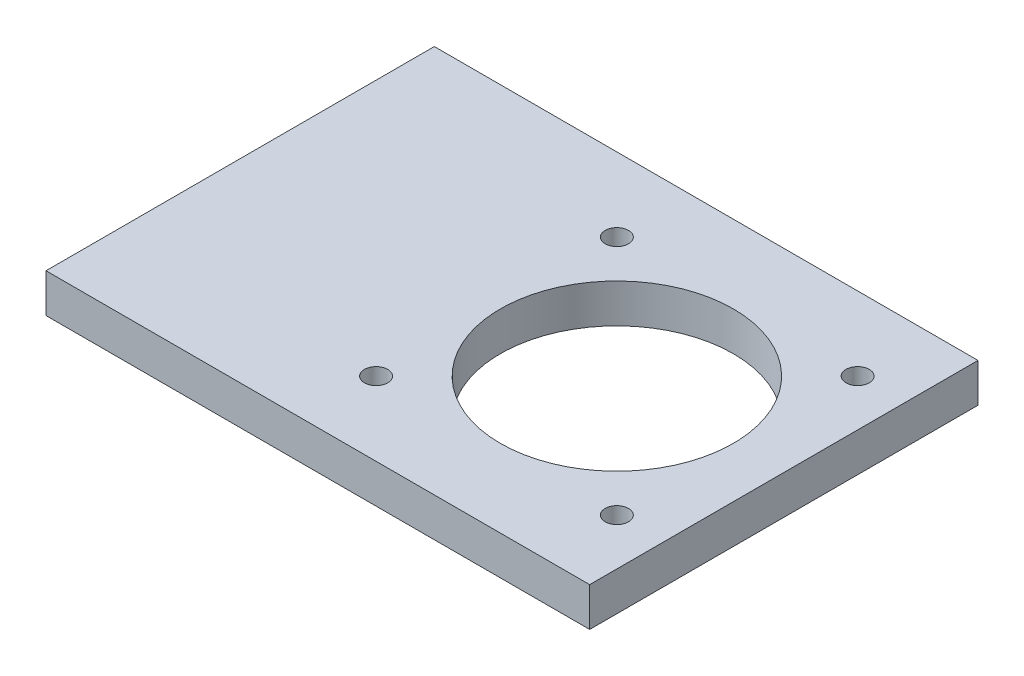
ISO-10303-21;
HEADER;
FILE_DESCRIPTION(('STEP AP214'),'2;1');
FILE_NAME('part.step','',(''),(''),'','','');
FILE_SCHEMA(('AUTOMOTIVE_DESIGN { 1 0 10303 214 1 1 1 1 }'));
ENDSEC;
DATA;
#1=APPLICATION_CONTEXT('core data for automotive mechanical design processes');
#2=APPLICATION_PROTOCOL_DEFINITION('international standard','automotive_design',2000,#1);
#3=PRODUCT_CONTEXT('',#1,'mechanical');
#4=PRODUCT('Part','Part','',(#3));
#5=PRODUCT_RELATED_PRODUCT_CATEGORY('part','',(#4));
#6=PRODUCT_DEFINITION_FORMATION('','',#4);
#7=PRODUCT_DEFINITION_CONTEXT('part definition',#1,'design');
#8=PRODUCT_DEFINITION('design','',#6,#7);
#9=PRODUCT_DEFINITION_SHAPE('','',#8);
#10=(LENGTH_UNIT() NAMED_UNIT(*) SI_UNIT(.MILLI.,.METRE.));
#11=(NAMED_UNIT(*) PLANE_ANGLE_UNIT() SI_UNIT($,.RADIAN.));
#12=(NAMED_UNIT(*) SI_UNIT($,.STERADIAN.) SOLID_ANGLE_UNIT());
#13=UNCERTAINTY_MEASURE_WITH_UNIT(LENGTH_MEASURE(1.E-05),#10,'distance_accuracy_value','');
#14=(GEOMETRIC_REPRESENTATION_CONTEXT(3) GLOBAL_UNCERTAINTY_ASSIGNED_CONTEXT((#13)) GLOBAL_UNIT_ASSIGNED_CONTEXT((#10,
#11,#12)) REPRESENTATION_CONTEXT('',''));
#15=CARTESIAN_POINT('',(0.,0.,0.));
#16=DIRECTION('',(0.,0.,1.));
#17=DIRECTION('',(1.,0.,0.));
#18=AXIS2_PLACEMENT_3D('',#15,#16,#17);
#19=CARTESIAN_POINT('',(-35.,5.,25.));
#20=DIRECTION('',(1.,0.,0.));
#21=DIRECTION('',(0.,0.,-1.));
#22=AXIS2_PLACEMENT_3D('',#19,#20,#21);
#23=PLANE('',#22);
#24=DIRECTION('',(0.,0.,1.));
#25=VECTOR('',#24,1.);
#26=CARTESIAN_POINT('',(-35.,0.,25.));
#27=LINE('',#26,#25);
#28=CARTESIAN_POINT('',(-35.,0.,-25.));
#29=VERTEX_POINT('',#28);
#30=CARTESIAN_POINT('',(-35.,0.,25.));
#31=VERTEX_POINT('',#30);
#32=EDGE_CURVE('E101',#29,#31,#27,.T.);
#33=ORIENTED_EDGE('',*,*,#32,.T.);
#34=DIRECTION('',(0.,-1.,0.));
#35=VECTOR('',#34,1.);
#36=CARTESIAN_POINT('',(-35.,5.,25.));
#37=LINE('',#36,#35);
#38=CARTESIAN_POINT('',(-35.,5.,25.));
#39=VERTEX_POINT('',#38);
#40=EDGE_CURVE('E11',#39,#31,#37,.T.);
#41=ORIENTED_EDGE('',*,*,#40,.F.);
#42=DIRECTION('',(0.,0.,1.));
#43=VECTOR('',#42,1.);
#44=CARTESIAN_POINT('',(-35.,5.,25.));
#45=LINE('',#44,#43);
#46=CARTESIAN_POINT('',(-35.,5.,-25.));
#47=VERTEX_POINT('',#46);
#48=EDGE_CURVE('E89',#47,#39,#45,.T.);
#49=ORIENTED_EDGE('',*,*,#48,.F.);
#50=DIRECTION('',(0.,-1.,0.));
#51=VECTOR('',#50,1.);
#52=CARTESIAN_POINT('',(-35.,5.,-25.));
#53=LINE('',#52,#51);
#54=EDGE_CURVE('E97',#47,#29,#53,.T.);
#55=ORIENTED_EDGE('',*,*,#54,.T.);
#56=EDGE_LOOP('',(#33,#41,#49,#55));
#57=FACE_BOUND('',#56,.T.);
#58=ADVANCED_FACE('F38',(#57),#23,.F.);
#59=CARTESIAN_POINT('',(35.,5.,25.));
#60=DIRECTION('',(0.,0.,-1.));
#61=DIRECTION('',(-1.,0.,0.));
#62=AXIS2_PLACEMENT_3D('',#59,#60,#61);
#63=PLANE('',#62);
#64=DIRECTION('',(1.,0.,0.));
#65=VECTOR('',#64,1.);
#66=CARTESIAN_POINT('',(35.,0.,25.));
#67=LINE('',#66,#65);
#68=CARTESIAN_POINT('',(35.,0.,25.));
#69=VERTEX_POINT('',#68);
#70=EDGE_CURVE('E93',#31,#69,#67,.T.);
#71=ORIENTED_EDGE('',*,*,#70,.T.);
#72=DIRECTION('',(0.,-1.,0.));
#73=VECTOR('',#72,1.);
#74=CARTESIAN_POINT('',(35.,5.,25.));
#75=LINE('',#74,#73);
#76=CARTESIAN_POINT('',(35.,5.,25.));
#77=VERTEX_POINT('',#76);
#78=EDGE_CURVE('E46',#77,#69,#75,.T.);
#79=ORIENTED_EDGE('',*,*,#78,.F.);
#80=DIRECTION('',(1.,0.,0.));
#81=VECTOR('',#80,1.);
#82=CARTESIAN_POINT('',(35.,5.,25.));
#83=LINE('',#82,#81);
#84=EDGE_CURVE('E84',#39,#77,#83,.T.);
#85=ORIENTED_EDGE('',*,*,#84,.F.);
#86=ORIENTED_EDGE('',*,*,#40,.T.);
#87=EDGE_LOOP('',(#71,#79,#85,#86));
#88=FACE_BOUND('',#87,.T.);
#89=ADVANCED_FACE('F92',(#88),#63,.F.);
#90=CARTESIAN_POINT('',(35.,5.,25.));
#91=DIRECTION('',(-1.,0.,0.));
#92=DIRECTION('',(0.,0.,1.));
#93=AXIS2_PLACEMENT_3D('',#90,#91,#92);
#94=PLANE('',#93);
#95=DIRECTION('',(0.,0.,-1.));
#96=VECTOR('',#95,1.);
#97=CARTESIAN_POINT('',(35.,0.,25.));
#98=LINE('',#97,#96);
#99=CARTESIAN_POINT('',(35.,0.,-25.));
#100=VERTEX_POINT('',#99);
#101=EDGE_CURVE('E71',#69,#100,#98,.T.);
#102=ORIENTED_EDGE('',*,*,#101,.T.);
#103=DIRECTION('',(0.,-1.,0.));
#104=VECTOR('',#103,1.);
#105=CARTESIAN_POINT('',(35.,5.,-25.));
#106=LINE('',#105,#104);
#107=CARTESIAN_POINT('',(35.,5.,-25.));
#108=VERTEX_POINT('',#107);
#109=EDGE_CURVE('E94',#108,#100,#106,.T.);
#110=ORIENTED_EDGE('',*,*,#109,.F.);
#111=DIRECTION('',(0.,0.,-1.));
#112=VECTOR('',#111,1.);
#113=CARTESIAN_POINT('',(35.,5.,25.));
#114=LINE('',#113,#112);
#115=EDGE_CURVE('E87',#77,#108,#114,.T.);
#116=ORIENTED_EDGE('',*,*,#115,.F.);
#117=ORIENTED_EDGE('',*,*,#78,.T.);
#118=EDGE_LOOP('',(#102,#110,#116,#117));
#119=FACE_BOUND('',#118,.T.);
#120=ADVANCED_FACE('F95',(#119),#94,.F.);
#121=CARTESIAN_POINT('',(35.,5.,-25.));
#122=DIRECTION('',(0.,0.,1.));
#123=DIRECTION('',(1.,0.,0.));
#124=AXIS2_PLACEMENT_3D('',#121,#122,#123);
#125=PLANE('',#124);
#126=DIRECTION('',(-1.,0.,0.));
#127=VECTOR('',#126,1.);
#128=CARTESIAN_POINT('',(35.,0.,-25.));
#129=LINE('',#128,#127);
#130=EDGE_CURVE('E77',#100,#29,#129,.T.);
#131=ORIENTED_EDGE('',*,*,#130,.T.);
#132=ORIENTED_EDGE('',*,*,#54,.F.);
#133=DIRECTION('',(-1.,0.,0.));
#134=VECTOR('',#133,1.);
#135=CARTESIAN_POINT('',(35.,5.,-25.));
#136=LINE('',#135,#134);
#137=EDGE_CURVE('E54',#108,#47,#136,.T.);
#138=ORIENTED_EDGE('',*,*,#137,.F.);
#139=ORIENTED_EDGE('',*,*,#109,.T.);
#140=EDGE_LOOP('',(#131,#132,#138,#139));
#141=FACE_BOUND('',#140,.T.);
#142=ADVANCED_FACE('F109',(#141),#125,.F.);
#143=CARTESIAN_POINT('',(0.,5.,0.));
#144=DIRECTION('',(0.,1.,0.));
#145=DIRECTION('',(0.,0.,1.));
#146=AXIS2_PLACEMENT_3D('',#143,#144,#145);
#147=PLANE('',#146);
#148=CARTESIAN_POINT('',(13.5,5.,0.));
#149=DIRECTION('',(0.,1.,0.));
#150=DIRECTION('',(0.,0.,1.));
#151=AXIS2_PLACEMENT_3D('',#148,#149,#150);
#152=CIRCLE('',#151,15.);
#153=CARTESIAN_POINT('',(13.5,5.,15.));
#154=VERTEX_POINT('',#153);
#155=EDGE_CURVE('E139',#154,#154,#152,.T.);
#156=ORIENTED_EDGE('',*,*,#155,.F.);
#157=EDGE_LOOP('',(#156));
#158=FACE_BOUND('',#157,.T.);
#159=CARTESIAN_POINT('',(29.,5.,15.5));
#160=DIRECTION('',(0.,-1.,0.));
#161=DIRECTION('',(0.,0.,-1.));
#162=AXIS2_PLACEMENT_3D('',#159,#160,#161);
#163=CIRCLE('',#162,1.5);
#164=CARTESIAN_POINT('',(29.,5.,14.));
#165=VERTEX_POINT('',#164);
#166=EDGE_CURVE('E134',#165,#165,#163,.T.);
#167=ORIENTED_EDGE('',*,*,#166,.T.);
#168=EDGE_LOOP('',(#167));
#169=FACE_BOUND('',#168,.T.);
#170=CARTESIAN_POINT('',(-1.99999999999999,5.,15.5));
#171=DIRECTION('',(0.,-1.,0.));
#172=DIRECTION('',(0.,0.,-1.));
#173=AXIS2_PLACEMENT_3D('',#170,#171,#172);
#174=CIRCLE('',#173,1.5);
#175=CARTESIAN_POINT('',(-1.99999999999999,5.,14.));
#176=VERTEX_POINT('',#175);
#177=EDGE_CURVE('E127',#176,#176,#174,.T.);
#178=ORIENTED_EDGE('',*,*,#177,.T.);
#179=EDGE_LOOP('',(#178));
#180=FACE_BOUND('',#179,.T.);
#181=CARTESIAN_POINT('',(29.,5.,-15.5));
#182=DIRECTION('',(0.,1.,0.));
#183=DIRECTION('',(0.,0.,1.));
#184=AXIS2_PLACEMENT_3D('',#181,#182,#183);
#185=CIRCLE('',#184,1.5);
#186=CARTESIAN_POINT('',(29.,5.,-14.));
#187=VERTEX_POINT('',#186);
#188=EDGE_CURVE('E122',#187,#187,#185,.T.);
#189=ORIENTED_EDGE('',*,*,#188,.F.);
#190=EDGE_LOOP('',(#189));
#191=FACE_BOUND('',#190,.T.);
#192=CARTESIAN_POINT('',(-1.99999999999999,5.,-15.5));
#193=DIRECTION('',(0.,1.,0.));
#194=DIRECTION('',(0.,0.,1.));
#195=AXIS2_PLACEMENT_3D('',#192,#193,#194);
#196=CIRCLE('',#195,1.5);
#197=CARTESIAN_POINT('',(-1.99999999999999,5.,-14.));
#198=VERTEX_POINT('',#197);
#199=EDGE_CURVE('E115',#198,#198,#196,.T.);
#200=ORIENTED_EDGE('',*,*,#199,.F.);
#201=EDGE_LOOP('',(#200));
#202=FACE_BOUND('',#201,.T.);
#203=ORIENTED_EDGE('',*,*,#48,.T.);
#204=ORIENTED_EDGE('',*,*,#84,.T.);
#205=ORIENTED_EDGE('',*,*,#115,.T.);
#206=ORIENTED_EDGE('',*,*,#137,.T.);
#207=EDGE_LOOP('',(#203,#204,#205,#206));
#208=FACE_BOUND('',#207,.T.);
#209=ADVANCED_FACE('F85',(#158,#169,#180,#191,#202,#208),#147,.T.);
#210=CARTESIAN_POINT('',(0.,0.,0.));
#211=DIRECTION('',(0.,1.,0.));
#212=DIRECTION('',(0.,0.,1.));
#213=AXIS2_PLACEMENT_3D('',#210,#211,#212);
#214=PLANE('',#213);
#215=CARTESIAN_POINT('',(13.5,0.,0.));
#216=DIRECTION('',(0.,1.,0.));
#217=DIRECTION('',(0.,0.,1.));
#218=AXIS2_PLACEMENT_3D('',#215,#216,#217);
#219=CIRCLE('',#218,15.);
#220=CARTESIAN_POINT('',(13.5,0.,15.));
#221=VERTEX_POINT('',#220);
#222=EDGE_CURVE('E131',#221,#221,#219,.T.);
#223=ORIENTED_EDGE('',*,*,#222,.T.);
#224=EDGE_LOOP('',(#223));
#225=FACE_BOUND('',#224,.T.);
#226=CARTESIAN_POINT('',(29.,0.,15.5));
#227=DIRECTION('',(0.,-1.,0.));
#228=DIRECTION('',(0.,0.,-1.));
#229=AXIS2_PLACEMENT_3D('',#226,#227,#228);
#230=CIRCLE('',#229,1.5);
#231=CARTESIAN_POINT('',(29.,0.,14.));
#232=VERTEX_POINT('',#231);
#233=EDGE_CURVE('E119',#232,#232,#230,.T.);
#234=ORIENTED_EDGE('',*,*,#233,.F.);
#235=EDGE_LOOP('',(#234));
#236=FACE_BOUND('',#235,.T.);
#237=CARTESIAN_POINT('',(-1.99999999999999,0.,15.5));
#238=DIRECTION('',(0.,-1.,0.));
#239=DIRECTION('',(0.,0.,-1.));
#240=AXIS2_PLACEMENT_3D('',#237,#238,#239);
#241=CIRCLE('',#240,1.5);
#242=CARTESIAN_POINT('',(-1.99999999999999,0.,14.));
#243=VERTEX_POINT('',#242);
#244=EDGE_CURVE('E130',#243,#243,#241,.T.);
#245=ORIENTED_EDGE('',*,*,#244,.F.);
#246=EDGE_LOOP('',(#245));
#247=FACE_BOUND('',#246,.T.);
#248=CARTESIAN_POINT('',(29.,0.,-15.5));
#249=DIRECTION('',(0.,1.,0.));
#250=DIRECTION('',(0.,0.,1.));
#251=AXIS2_PLACEMENT_3D('',#248,#249,#250);
#252=CIRCLE('',#251,1.5);
#253=CARTESIAN_POINT('',(29.,0.,-14.));
#254=VERTEX_POINT('',#253);
#255=EDGE_CURVE('E104',#254,#254,#252,.T.);
#256=ORIENTED_EDGE('',*,*,#255,.T.);
#257=EDGE_LOOP('',(#256));
#258=FACE_BOUND('',#257,.T.);
#259=CARTESIAN_POINT('',(-1.99999999999999,0.,-15.5));
#260=DIRECTION('',(0.,1.,0.));
#261=DIRECTION('',(0.,0.,1.));
#262=AXIS2_PLACEMENT_3D('',#259,#260,#261);
#263=CIRCLE('',#262,1.5);
#264=CARTESIAN_POINT('',(-1.99999999999999,0.,-14.));
#265=VERTEX_POINT('',#264);
#266=EDGE_CURVE('E118',#265,#265,#263,.T.);
#267=ORIENTED_EDGE('',*,*,#266,.T.);
#268=EDGE_LOOP('',(#267));
#269=FACE_BOUND('',#268,.T.);
#270=ORIENTED_EDGE('',*,*,#32,.F.);
#271=ORIENTED_EDGE('',*,*,#130,.F.);
#272=ORIENTED_EDGE('',*,*,#101,.F.);
#273=ORIENTED_EDGE('',*,*,#70,.F.);
#274=EDGE_LOOP('',(#270,#271,#272,#273));
#275=FACE_BOUND('',#274,.T.);
#276=ADVANCED_FACE('F112',(#225,#236,#247,#258,#269,#275),#214,.F.);
#277=CARTESIAN_POINT('',(-1.99999999999999,0.,-15.5));
#278=DIRECTION('',(0.,1.,0.));
#279=DIRECTION('',(0.,0.,1.));
#280=AXIS2_PLACEMENT_3D('',#277,#278,#279);
#281=CYLINDRICAL_SURFACE('',#280,1.5);
#282=ORIENTED_EDGE('',*,*,#266,.F.);
#283=EDGE_LOOP('',(#282));
#284=FACE_BOUND('',#283,.T.);
#285=ORIENTED_EDGE('',*,*,#199,.T.);
#286=EDGE_LOOP('',(#285));
#287=FACE_BOUND('',#286,.T.);
#288=ADVANCED_FACE('F165',(#284,#287),#281,.F.);
#289=CARTESIAN_POINT('',(29.,0.,-15.5));
#290=DIRECTION('',(0.,1.,0.));
#291=DIRECTION('',(0.,0.,1.));
#292=AXIS2_PLACEMENT_3D('',#289,#290,#291);
#293=CYLINDRICAL_SURFACE('',#292,1.5);
#294=ORIENTED_EDGE('',*,*,#255,.F.);
#295=EDGE_LOOP('',(#294));
#296=FACE_BOUND('',#295,.T.);
#297=ORIENTED_EDGE('',*,*,#188,.T.);
#298=EDGE_LOOP('',(#297));
#299=FACE_BOUND('',#298,.T.);
#300=ADVANCED_FACE('F167',(#296,#299),#293,.F.);
#301=CARTESIAN_POINT('',(-1.99999999999999,0.,15.5));
#302=DIRECTION('',(0.,1.,0.));
#303=DIRECTION('',(0.,0.,1.));
#304=AXIS2_PLACEMENT_3D('',#301,#302,#303);
#305=CYLINDRICAL_SURFACE('',#304,1.5);
#306=ORIENTED_EDGE('',*,*,#244,.T.);
#307=EDGE_LOOP('',(#306));
#308=FACE_BOUND('',#307,.T.);
#309=ORIENTED_EDGE('',*,*,#177,.F.);
#310=EDGE_LOOP('',(#309));
#311=FACE_BOUND('',#310,.T.);
#312=ADVANCED_FACE('F174',(#308,#311),#305,.F.);
#313=CARTESIAN_POINT('',(29.,0.,15.5));
#314=DIRECTION('',(0.,1.,0.));
#315=DIRECTION('',(0.,0.,1.));
#316=AXIS2_PLACEMENT_3D('',#313,#314,#315);
#317=CYLINDRICAL_SURFACE('',#316,1.5);
#318=ORIENTED_EDGE('',*,*,#233,.T.);
#319=EDGE_LOOP('',(#318));
#320=FACE_BOUND('',#319,.T.);
#321=ORIENTED_EDGE('',*,*,#166,.F.);
#322=EDGE_LOOP('',(#321));
#323=FACE_BOUND('',#322,.T.);
#324=ADVANCED_FACE('F150',(#320,#323),#317,.F.);
#325=CARTESIAN_POINT('',(13.5,0.,0.));
#326=DIRECTION('',(0.,1.,0.));
#327=DIRECTION('',(0.,0.,1.));
#328=AXIS2_PLACEMENT_3D('',#325,#326,#327);
#329=CYLINDRICAL_SURFACE('',#328,15.);
#330=ORIENTED_EDGE('',*,*,#222,.F.);
#331=EDGE_LOOP('',(#330));
#332=FACE_BOUND('',#331,.T.);
#333=ORIENTED_EDGE('',*,*,#155,.T.);
#334=EDGE_LOOP('',(#333));
#335=FACE_BOUND('',#334,.T.);
#336=ADVANCED_FACE('F147',(#332,#335),#329,.F.);
#337=CLOSED_SHELL('',(#58,#89,#120,#142,#209,#276,#288,#300,#312,#324,#336));
#338=MANIFOLD_SOLID_BREP('B2',#337);
#339=ADVANCED_BREP_SHAPE_REPRESENTATION('',(#18,#338),#14);
#340=SHAPE_DEFINITION_REPRESENTATION(#9,#339);
ENDSEC;
END-ISO-10303-21;
